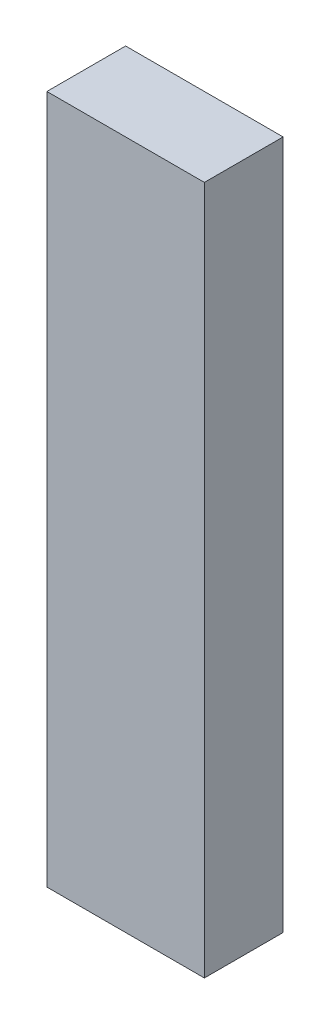
ISO-10303-21;
HEADER;
FILE_DESCRIPTION(('STEP AP214'),'2;1');
FILE_NAME('part.step','',(''),(''),'','','');
FILE_SCHEMA(('AUTOMOTIVE_DESIGN { 1 0 10303 214 1 1 1 1 }'));
ENDSEC;
DATA;
#1=APPLICATION_CONTEXT('core data for automotive mechanical design processes');
#2=APPLICATION_PROTOCOL_DEFINITION('international standard','automotive_design',2000,#1);
#3=PRODUCT_CONTEXT('',#1,'mechanical');
#4=PRODUCT('Part','Part','',(#3));
#5=PRODUCT_RELATED_PRODUCT_CATEGORY('part','',(#4));
#6=PRODUCT_DEFINITION_FORMATION('','',#4);
#7=PRODUCT_DEFINITION_CONTEXT('part definition',#1,'design');
#8=PRODUCT_DEFINITION('design','',#6,#7);
#9=PRODUCT_DEFINITION_SHAPE('','',#8);
#10=(LENGTH_UNIT() NAMED_UNIT(*) SI_UNIT(.MILLI.,.METRE.));
#11=(NAMED_UNIT(*) PLANE_ANGLE_UNIT() SI_UNIT($,.RADIAN.));
#12=(NAMED_UNIT(*) SI_UNIT($,.STERADIAN.) SOLID_ANGLE_UNIT());
#13=UNCERTAINTY_MEASURE_WITH_UNIT(LENGTH_MEASURE(1.E-05),#10,'distance_accuracy_value','');
#14=(GEOMETRIC_REPRESENTATION_CONTEXT(3) GLOBAL_UNCERTAINTY_ASSIGNED_CONTEXT((#13)) GLOBAL_UNIT_ASSIGNED_CONTEXT((#10,
#11,#12)) REPRESENTATION_CONTEXT('',''));
#15=CARTESIAN_POINT('',(0.,0.,0.));
#16=DIRECTION('',(0.,0.,1.));
#17=DIRECTION('',(1.,0.,0.));
#18=AXIS2_PLACEMENT_3D('',#15,#16,#17);
#19=CARTESIAN_POINT('',(4.,-17.5,4.));
#20=DIRECTION('',(-1.,0.,0.));
#21=DIRECTION('',(0.,0.,1.));
#22=AXIS2_PLACEMENT_3D('',#19,#20,#21);
#23=PLANE('',#22);
#24=DIRECTION('',(0.,1.,0.));
#25=VECTOR('',#24,1.);
#26=CARTESIAN_POINT('',(4.,-17.5,0.));
#27=LINE('',#26,#25);
#28=CARTESIAN_POINT('',(4.,-17.5,0.));
#29=VERTEX_POINT('',#28);
#30=CARTESIAN_POINT('',(4.,17.5,0.));
#31=VERTEX_POINT('',#30);
#32=EDGE_CURVE('E96',#29,#31,#27,.T.);
#33=ORIENTED_EDGE('',*,*,#32,.T.);
#34=DIRECTION('',(0.,0.,-1.));
#35=VECTOR('',#34,1.);
#36=CARTESIAN_POINT('',(4.,17.5,4.));
#37=LINE('',#36,#35);
#38=CARTESIAN_POINT('',(4.,17.5,4.));
#39=VERTEX_POINT('',#38);
#40=EDGE_CURVE('E11',#39,#31,#37,.T.);
#41=ORIENTED_EDGE('',*,*,#40,.F.);
#42=DIRECTION('',(0.,1.,0.));
#43=VECTOR('',#42,1.);
#44=CARTESIAN_POINT('',(4.,-17.5,4.));
#45=LINE('',#44,#43);
#46=CARTESIAN_POINT('',(4.,-17.5,4.));
#47=VERTEX_POINT('',#46);
#48=EDGE_CURVE('E84',#47,#39,#45,.T.);
#49=ORIENTED_EDGE('',*,*,#48,.F.);
#50=DIRECTION('',(0.,0.,-1.));
#51=VECTOR('',#50,1.);
#52=CARTESIAN_POINT('',(4.,-17.5,4.));
#53=LINE('',#52,#51);
#54=EDGE_CURVE('E92',#47,#29,#53,.T.);
#55=ORIENTED_EDGE('',*,*,#54,.T.);
#56=EDGE_LOOP('',(#33,#41,#49,#55));
#57=FACE_BOUND('',#56,.T.);
#58=ADVANCED_FACE('F33',(#57),#23,.F.);
#59=CARTESIAN_POINT('',(-4.,17.5,4.));
#60=DIRECTION('',(0.,-1.,0.));
#61=DIRECTION('',(0.,0.,-1.));
#62=AXIS2_PLACEMENT_3D('',#59,#60,#61);
#63=PLANE('',#62);
#64=DIRECTION('',(-1.,0.,0.));
#65=VECTOR('',#64,1.);
#66=CARTESIAN_POINT('',(-4.,17.5,0.));
#67=LINE('',#66,#65);
#68=CARTESIAN_POINT('',(-4.,17.5,0.));
#69=VERTEX_POINT('',#68);
#70=EDGE_CURVE('E88',#31,#69,#67,.T.);
#71=ORIENTED_EDGE('',*,*,#70,.T.);
#72=DIRECTION('',(0.,0.,-1.));
#73=VECTOR('',#72,1.);
#74=CARTESIAN_POINT('',(-4.,17.5,4.));
#75=LINE('',#74,#73);
#76=CARTESIAN_POINT('',(-4.,17.5,4.));
#77=VERTEX_POINT('',#76);
#78=EDGE_CURVE('E41',#77,#69,#75,.T.);
#79=ORIENTED_EDGE('',*,*,#78,.F.);
#80=DIRECTION('',(-1.,0.,0.));
#81=VECTOR('',#80,1.);
#82=CARTESIAN_POINT('',(-4.,17.5,4.));
#83=LINE('',#82,#81);
#84=EDGE_CURVE('E79',#39,#77,#83,.T.);
#85=ORIENTED_EDGE('',*,*,#84,.F.);
#86=ORIENTED_EDGE('',*,*,#40,.T.);
#87=EDGE_LOOP('',(#71,#79,#85,#86));
#88=FACE_BOUND('',#87,.T.);
#89=ADVANCED_FACE('F87',(#88),#63,.F.);
#90=CARTESIAN_POINT('',(-4.,-17.5,4.));
#91=DIRECTION('',(1.,0.,0.));
#92=DIRECTION('',(0.,0.,-1.));
#93=AXIS2_PLACEMENT_3D('',#90,#91,#92);
#94=PLANE('',#93);
#95=DIRECTION('',(0.,-1.,0.));
#96=VECTOR('',#95,1.);
#97=CARTESIAN_POINT('',(-4.,-17.5,0.));
#98=LINE('',#97,#96);
#99=CARTESIAN_POINT('',(-4.,-17.5,0.));
#100=VERTEX_POINT('',#99);
#101=EDGE_CURVE('E66',#69,#100,#98,.T.);
#102=ORIENTED_EDGE('',*,*,#101,.T.);
#103=DIRECTION('',(0.,0.,-1.));
#104=VECTOR('',#103,1.);
#105=CARTESIAN_POINT('',(-4.,-17.5,4.));
#106=LINE('',#105,#104);
#107=CARTESIAN_POINT('',(-4.,-17.5,4.));
#108=VERTEX_POINT('',#107);
#109=EDGE_CURVE('E89',#108,#100,#106,.T.);
#110=ORIENTED_EDGE('',*,*,#109,.F.);
#111=DIRECTION('',(0.,-1.,0.));
#112=VECTOR('',#111,1.);
#113=CARTESIAN_POINT('',(-4.,-17.5,4.));
#114=LINE('',#113,#112);
#115=EDGE_CURVE('E82',#77,#108,#114,.T.);
#116=ORIENTED_EDGE('',*,*,#115,.F.);
#117=ORIENTED_EDGE('',*,*,#78,.T.);
#118=EDGE_LOOP('',(#102,#110,#116,#117));
#119=FACE_BOUND('',#118,.T.);
#120=ADVANCED_FACE('F90',(#119),#94,.F.);
#121=CARTESIAN_POINT('',(-4.,-17.5,4.));
#122=DIRECTION('',(0.,1.,0.));
#123=DIRECTION('',(0.,0.,1.));
#124=AXIS2_PLACEMENT_3D('',#121,#122,#123);
#125=PLANE('',#124);
#126=DIRECTION('',(1.,0.,0.));
#127=VECTOR('',#126,1.);
#128=CARTESIAN_POINT('',(-4.,-17.5,0.));
#129=LINE('',#128,#127);
#130=EDGE_CURVE('E72',#100,#29,#129,.T.);
#131=ORIENTED_EDGE('',*,*,#130,.T.);
#132=ORIENTED_EDGE('',*,*,#54,.F.);
#133=DIRECTION('',(1.,0.,0.));
#134=VECTOR('',#133,1.);
#135=CARTESIAN_POINT('',(-4.,-17.5,4.));
#136=LINE('',#135,#134);
#137=EDGE_CURVE('E49',#108,#47,#136,.T.);
#138=ORIENTED_EDGE('',*,*,#137,.F.);
#139=ORIENTED_EDGE('',*,*,#109,.T.);
#140=EDGE_LOOP('',(#131,#132,#138,#139));
#141=FACE_BOUND('',#140,.T.);
#142=ADVANCED_FACE('F103',(#141),#125,.F.);
#143=CARTESIAN_POINT('',(0.,0.,4.));
#144=DIRECTION('',(0.,0.,-1.));
#145=DIRECTION('',(-1.,0.,0.));
#146=AXIS2_PLACEMENT_3D('',#143,#144,#145);
#147=PLANE('',#146);
#148=ORIENTED_EDGE('',*,*,#48,.T.);
#149=ORIENTED_EDGE('',*,*,#84,.T.);
#150=ORIENTED_EDGE('',*,*,#115,.T.);
#151=ORIENTED_EDGE('',*,*,#137,.T.);
#152=EDGE_LOOP('',(#148,#149,#150,#151));
#153=FACE_BOUND('',#152,.T.);
#154=ADVANCED_FACE('F80',(#153),#147,.F.);
#155=CARTESIAN_POINT('',(0.,0.,0.));
#156=DIRECTION('',(0.,0.,-1.));
#157=DIRECTION('',(-1.,0.,0.));
#158=AXIS2_PLACEMENT_3D('',#155,#156,#157);
#159=PLANE('',#158);
#160=ORIENTED_EDGE('',*,*,#32,.F.);
#161=ORIENTED_EDGE('',*,*,#130,.F.);
#162=ORIENTED_EDGE('',*,*,#101,.F.);
#163=ORIENTED_EDGE('',*,*,#70,.F.);
#164=EDGE_LOOP('',(#160,#161,#162,#163));
#165=FACE_BOUND('',#164,.T.);
#166=ADVANCED_FACE('F106',(#165),#159,.T.);
#167=CLOSED_SHELL('',(#58,#89,#120,#142,#154,#166));
#168=MANIFOLD_SOLID_BREP('B2',#167);
#169=ADVANCED_BREP_SHAPE_REPRESENTATION('',(#18,#168),#14);
#170=SHAPE_DEFINITION_REPRESENTATION(#9,#169);
ENDSEC;
END-ISO-10303-21;
